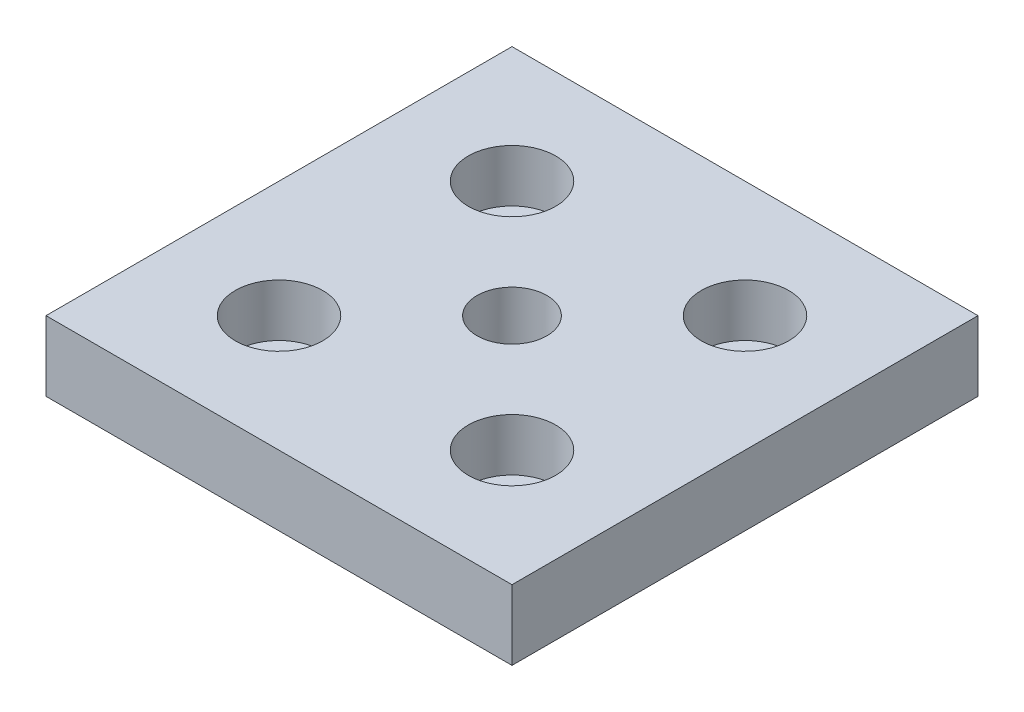
ISO-10303-21;
HEADER;
FILE_DESCRIPTION(('STEP AP214'),'2;1');
FILE_NAME('part.step','',(''),(''),'','','');
FILE_SCHEMA(('AUTOMOTIVE_DESIGN { 1 0 10303 214 1 1 1 1 }'));
ENDSEC;
DATA;
#1=APPLICATION_CONTEXT('core data for automotive mechanical design processes');
#2=APPLICATION_PROTOCOL_DEFINITION('international standard','automotive_design',2000,#1);
#3=PRODUCT_CONTEXT('',#1,'mechanical');
#4=PRODUCT('Part','Part','',(#3));
#5=PRODUCT_RELATED_PRODUCT_CATEGORY('part','',(#4));
#6=PRODUCT_DEFINITION_FORMATION('','',#4);
#7=PRODUCT_DEFINITION_CONTEXT('part definition',#1,'design');
#8=PRODUCT_DEFINITION('design','',#6,#7);
#9=PRODUCT_DEFINITION_SHAPE('','',#8);
#10=(LENGTH_UNIT() NAMED_UNIT(*) SI_UNIT(.MILLI.,.METRE.));
#11=(NAMED_UNIT(*) PLANE_ANGLE_UNIT() SI_UNIT($,.RADIAN.));
#12=(NAMED_UNIT(*) SI_UNIT($,.STERADIAN.) SOLID_ANGLE_UNIT());
#13=UNCERTAINTY_MEASURE_WITH_UNIT(LENGTH_MEASURE(1.E-05),#10,'distance_accuracy_value','');
#14=(GEOMETRIC_REPRESENTATION_CONTEXT(3) GLOBAL_UNCERTAINTY_ASSIGNED_CONTEXT((#13)) GLOBAL_UNIT_ASSIGNED_CONTEXT((#10,
#11,#12)) REPRESENTATION_CONTEXT('',''));
#15=CARTESIAN_POINT('',(0.,0.,0.));
#16=DIRECTION('',(0.,0.,1.));
#17=DIRECTION('',(1.,0.,0.));
#18=AXIS2_PLACEMENT_3D('',#15,#16,#17);
#19=CARTESIAN_POINT('',(-20.,0.,-20.));
#20=DIRECTION('',(0.,1.,0.));
#21=DIRECTION('',(0.,0.,1.));
#22=AXIS2_PLACEMENT_3D('',#19,#20,#21);
#23=CYLINDRICAL_SURFACE('',#22,4.5);
#24=CARTESIAN_POINT('',(-20.,0.,-20.));
#25=DIRECTION('',(0.,1.,0.));
#26=DIRECTION('',(0.,0.,1.));
#27=AXIS2_PLACEMENT_3D('',#24,#25,#26);
#28=CIRCLE('',#27,4.5);
#29=CARTESIAN_POINT('',(-20.,0.,-15.5));
#30=VERTEX_POINT('',#29);
#31=EDGE_CURVE('E137',#30,#30,#28,.T.);
#32=ORIENTED_EDGE('',*,*,#31,.F.);
#33=EDGE_LOOP('',(#32));
#34=FACE_BOUND('',#33,.T.);
#35=CARTESIAN_POINT('',(-20.,3.,-20.));
#36=DIRECTION('',(0.,1.,0.));
#37=DIRECTION('',(0.,0.,1.));
#38=AXIS2_PLACEMENT_3D('',#35,#36,#37);
#39=CIRCLE('',#38,4.5);
#40=CARTESIAN_POINT('',(-20.,3.,-15.5));
#41=VERTEX_POINT('',#40);
#42=EDGE_CURVE('E41',#41,#41,#39,.F.);
#43=ORIENTED_EDGE('',*,*,#42,.F.);
#44=EDGE_LOOP('',(#43));
#45=FACE_BOUND('',#44,.T.);
#46=ADVANCED_FACE('F37',(#34,#45),#23,.F.);
#47=CARTESIAN_POINT('',(20.,0.,-20.));
#48=DIRECTION('',(0.,1.,0.));
#49=DIRECTION('',(0.,0.,1.));
#50=AXIS2_PLACEMENT_3D('',#47,#48,#49);
#51=CYLINDRICAL_SURFACE('',#50,4.5);
#52=CARTESIAN_POINT('',(20.,0.,-20.));
#53=DIRECTION('',(0.,1.,0.));
#54=DIRECTION('',(0.,0.,1.));
#55=AXIS2_PLACEMENT_3D('',#52,#53,#54);
#56=CIRCLE('',#55,4.5);
#57=CARTESIAN_POINT('',(20.,0.,-15.5));
#58=VERTEX_POINT('',#57);
#59=EDGE_CURVE('E133',#58,#58,#56,.T.);
#60=ORIENTED_EDGE('',*,*,#59,.F.);
#61=EDGE_LOOP('',(#60));
#62=FACE_BOUND('',#61,.T.);
#63=CARTESIAN_POINT('',(20.,3.,-20.));
#64=DIRECTION('',(0.,1.,0.));
#65=DIRECTION('',(0.,0.,1.));
#66=AXIS2_PLACEMENT_3D('',#63,#64,#65);
#67=CIRCLE('',#66,4.5);
#68=CARTESIAN_POINT('',(20.,3.,-15.5));
#69=VERTEX_POINT('',#68);
#70=EDGE_CURVE('E119',#69,#69,#67,.F.);
#71=ORIENTED_EDGE('',*,*,#70,.F.);
#72=EDGE_LOOP('',(#71));
#73=FACE_BOUND('',#72,.T.);
#74=ADVANCED_FACE('F165',(#62,#73),#51,.F.);
#75=CARTESIAN_POINT('',(20.,0.,20.));
#76=DIRECTION('',(0.,1.,0.));
#77=DIRECTION('',(0.,0.,1.));
#78=AXIS2_PLACEMENT_3D('',#75,#76,#77);
#79=CYLINDRICAL_SURFACE('',#78,4.5);
#80=CARTESIAN_POINT('',(20.,0.,20.));
#81=DIRECTION('',(0.,1.,0.));
#82=DIRECTION('',(0.,0.,1.));
#83=AXIS2_PLACEMENT_3D('',#80,#81,#82);
#84=CIRCLE('',#83,4.5);
#85=CARTESIAN_POINT('',(20.,0.,24.5));
#86=VERTEX_POINT('',#85);
#87=EDGE_CURVE('E128',#86,#86,#84,.T.);
#88=ORIENTED_EDGE('',*,*,#87,.F.);
#89=EDGE_LOOP('',(#88));
#90=FACE_BOUND('',#89,.T.);
#91=CARTESIAN_POINT('',(20.,3.,20.));
#92=DIRECTION('',(0.,1.,0.));
#93=DIRECTION('',(0.,0.,1.));
#94=AXIS2_PLACEMENT_3D('',#91,#92,#93);
#95=CIRCLE('',#94,4.5);
#96=CARTESIAN_POINT('',(20.,3.,24.5));
#97=VERTEX_POINT('',#96);
#98=EDGE_CURVE('E116',#97,#97,#95,.F.);
#99=ORIENTED_EDGE('',*,*,#98,.F.);
#100=EDGE_LOOP('',(#99));
#101=FACE_BOUND('',#100,.T.);
#102=ADVANCED_FACE('F171',(#90,#101),#79,.F.);
#103=CARTESIAN_POINT('',(-20.,0.,20.));
#104=DIRECTION('',(0.,1.,0.));
#105=DIRECTION('',(0.,0.,1.));
#106=AXIS2_PLACEMENT_3D('',#103,#104,#105);
#107=CYLINDRICAL_SURFACE('',#106,4.5);
#108=CARTESIAN_POINT('',(-20.,0.,20.));
#109=DIRECTION('',(0.,1.,0.));
#110=DIRECTION('',(0.,0.,1.));
#111=AXIS2_PLACEMENT_3D('',#108,#109,#110);
#112=CIRCLE('',#111,4.5);
#113=CARTESIAN_POINT('',(-20.,0.,24.5));
#114=VERTEX_POINT('',#113);
#115=EDGE_CURVE('E124',#114,#114,#112,.T.);
#116=ORIENTED_EDGE('',*,*,#115,.F.);
#117=EDGE_LOOP('',(#116));
#118=FACE_BOUND('',#117,.T.);
#119=CARTESIAN_POINT('',(-20.,3.,20.));
#120=DIRECTION('',(0.,1.,0.));
#121=DIRECTION('',(0.,0.,1.));
#122=AXIS2_PLACEMENT_3D('',#119,#120,#121);
#123=CIRCLE('',#122,4.5);
#124=CARTESIAN_POINT('',(-20.,3.,24.5));
#125=VERTEX_POINT('',#124);
#126=EDGE_CURVE('E113',#125,#125,#123,.F.);
#127=ORIENTED_EDGE('',*,*,#126,.F.);
#128=EDGE_LOOP('',(#127));
#129=FACE_BOUND('',#128,.T.);
#130=ADVANCED_FACE('F178',(#118,#129),#107,.F.);
#131=CARTESIAN_POINT('',(40.,12.,40.));
#132=DIRECTION('',(-1.,0.,0.));
#133=DIRECTION('',(0.,0.,1.));
#134=AXIS2_PLACEMENT_3D('',#131,#132,#133);
#135=PLANE('',#134);
#136=DIRECTION('',(0.,0.,-1.));
#137=VECTOR('',#136,1.);
#138=CARTESIAN_POINT('',(40.,0.,40.));
#139=LINE('',#138,#137);
#140=CARTESIAN_POINT('',(40.,0.,40.));
#141=VERTEX_POINT('',#140);
#142=CARTESIAN_POINT('',(40.,0.,-40.));
#143=VERTEX_POINT('',#142);
#144=EDGE_CURVE('E104',#141,#143,#139,.T.);
#145=ORIENTED_EDGE('',*,*,#144,.T.);
#146=DIRECTION('',(0.,-1.,0.));
#147=VECTOR('',#146,1.);
#148=CARTESIAN_POINT('',(40.,12.,-40.));
#149=LINE('',#148,#147);
#150=CARTESIAN_POINT('',(40.,12.,-40.));
#151=VERTEX_POINT('',#150);
#152=EDGE_CURVE('E11',#151,#143,#149,.T.);
#153=ORIENTED_EDGE('',*,*,#152,.F.);
#154=DIRECTION('',(0.,0.,-1.));
#155=VECTOR('',#154,1.);
#156=CARTESIAN_POINT('',(40.,12.,40.));
#157=LINE('',#156,#155);
#158=CARTESIAN_POINT('',(40.,12.,40.));
#159=VERTEX_POINT('',#158);
#160=EDGE_CURVE('E91',#159,#151,#157,.T.);
#161=ORIENTED_EDGE('',*,*,#160,.F.);
#162=DIRECTION('',(0.,-1.,0.));
#163=VECTOR('',#162,1.);
#164=CARTESIAN_POINT('',(40.,12.,40.));
#165=LINE('',#164,#163);
#166=EDGE_CURVE('E100',#159,#141,#165,.T.);
#167=ORIENTED_EDGE('',*,*,#166,.T.);
#168=EDGE_LOOP('',(#145,#153,#161,#167));
#169=FACE_BOUND('',#168,.T.);
#170=ADVANCED_FACE('F39',(#169),#135,.F.);
#171=CARTESIAN_POINT('',(-40.,12.,-40.));
#172=DIRECTION('',(0.,0.,1.));
#173=DIRECTION('',(1.,0.,0.));
#174=AXIS2_PLACEMENT_3D('',#171,#172,#173);
#175=PLANE('',#174);
#176=DIRECTION('',(-1.,0.,0.));
#177=VECTOR('',#176,1.);
#178=CARTESIAN_POINT('',(-40.,0.,-40.));
#179=LINE('',#178,#177);
#180=CARTESIAN_POINT('',(-40.,0.,-40.));
#181=VERTEX_POINT('',#180);
#182=EDGE_CURVE('E95',#143,#181,#179,.T.);
#183=ORIENTED_EDGE('',*,*,#182,.T.);
#184=DIRECTION('',(0.,-1.,0.));
#185=VECTOR('',#184,1.);
#186=CARTESIAN_POINT('',(-40.,12.,-40.));
#187=LINE('',#186,#185);
#188=CARTESIAN_POINT('',(-40.,12.,-40.));
#189=VERTEX_POINT('',#188);
#190=EDGE_CURVE('E47',#189,#181,#187,.T.);
#191=ORIENTED_EDGE('',*,*,#190,.F.);
#192=DIRECTION('',(-1.,0.,0.));
#193=VECTOR('',#192,1.);
#194=CARTESIAN_POINT('',(-40.,12.,-40.));
#195=LINE('',#194,#193);
#196=EDGE_CURVE('E86',#151,#189,#195,.T.);
#197=ORIENTED_EDGE('',*,*,#196,.F.);
#198=ORIENTED_EDGE('',*,*,#152,.T.);
#199=EDGE_LOOP('',(#183,#191,#197,#198));
#200=FACE_BOUND('',#199,.T.);
#201=ADVANCED_FACE('F94',(#200),#175,.F.);
#202=CARTESIAN_POINT('',(-40.,12.,40.));
#203=DIRECTION('',(1.,0.,0.));
#204=DIRECTION('',(0.,0.,-1.));
#205=AXIS2_PLACEMENT_3D('',#202,#203,#204);
#206=PLANE('',#205);
#207=DIRECTION('',(0.,0.,1.));
#208=VECTOR('',#207,1.);
#209=CARTESIAN_POINT('',(-40.,0.,40.));
#210=LINE('',#209,#208);
#211=CARTESIAN_POINT('',(-40.,0.,40.));
#212=VERTEX_POINT('',#211);
#213=EDGE_CURVE('E73',#181,#212,#210,.T.);
#214=ORIENTED_EDGE('',*,*,#213,.T.);
#215=DIRECTION('',(0.,-1.,0.));
#216=VECTOR('',#215,1.);
#217=CARTESIAN_POINT('',(-40.,12.,40.));
#218=LINE('',#217,#216);
#219=CARTESIAN_POINT('',(-40.,12.,40.));
#220=VERTEX_POINT('',#219);
#221=EDGE_CURVE('E96',#220,#212,#218,.T.);
#222=ORIENTED_EDGE('',*,*,#221,.F.);
#223=DIRECTION('',(0.,0.,1.));
#224=VECTOR('',#223,1.);
#225=CARTESIAN_POINT('',(-40.,12.,40.));
#226=LINE('',#225,#224);
#227=EDGE_CURVE('E89',#189,#220,#226,.T.);
#228=ORIENTED_EDGE('',*,*,#227,.F.);
#229=ORIENTED_EDGE('',*,*,#190,.T.);
#230=EDGE_LOOP('',(#214,#222,#228,#229));
#231=FACE_BOUND('',#230,.T.);
#232=ADVANCED_FACE('F98',(#231),#206,.F.);
#233=CARTESIAN_POINT('',(-40.,12.,40.));
#234=DIRECTION('',(0.,0.,-1.));
#235=DIRECTION('',(-1.,0.,0.));
#236=AXIS2_PLACEMENT_3D('',#233,#234,#235);
#237=PLANE('',#236);
#238=DIRECTION('',(1.,0.,0.));
#239=VECTOR('',#238,1.);
#240=CARTESIAN_POINT('',(-40.,0.,40.));
#241=LINE('',#240,#239);
#242=EDGE_CURVE('E79',#212,#141,#241,.T.);
#243=ORIENTED_EDGE('',*,*,#242,.T.);
#244=ORIENTED_EDGE('',*,*,#166,.F.);
#245=DIRECTION('',(1.,0.,0.));
#246=VECTOR('',#245,1.);
#247=CARTESIAN_POINT('',(-40.,12.,40.));
#248=LINE('',#247,#246);
#249=EDGE_CURVE('E56',#220,#159,#248,.T.);
#250=ORIENTED_EDGE('',*,*,#249,.F.);
#251=ORIENTED_EDGE('',*,*,#221,.T.);
#252=EDGE_LOOP('',(#243,#244,#250,#251));
#253=FACE_BOUND('',#252,.T.);
#254=ADVANCED_FACE('F154',(#253),#237,.F.);
#255=CARTESIAN_POINT('',(0.,12.,0.));
#256=DIRECTION('',(0.,-1.,0.));
#257=DIRECTION('',(0.,0.,-1.));
#258=AXIS2_PLACEMENT_3D('',#255,#256,#257);
#259=PLANE('',#258);
#260=CARTESIAN_POINT('',(-20.,12.,20.));
#261=DIRECTION('',(0.,1.,0.));
#262=DIRECTION('',(0.,0.,1.));
#263=AXIS2_PLACEMENT_3D('',#260,#261,#262);
#264=CIRCLE('',#263,7.5);
#265=CARTESIAN_POINT('',(-20.,12.,27.5));
#266=VERTEX_POINT('',#265);
#267=EDGE_CURVE('E255',#266,#266,#264,.T.);
#268=ORIENTED_EDGE('',*,*,#267,.F.);
#269=EDGE_LOOP('',(#268));
#270=FACE_BOUND('',#269,.T.);
#271=CARTESIAN_POINT('',(20.,12.,20.));
#272=DIRECTION('',(0.,1.,0.));
#273=DIRECTION('',(0.,0.,1.));
#274=AXIS2_PLACEMENT_3D('',#271,#272,#273);
#275=CIRCLE('',#274,7.5);
#276=CARTESIAN_POINT('',(20.,12.,27.5));
#277=VERTEX_POINT('',#276);
#278=EDGE_CURVE('E250',#277,#277,#275,.T.);
#279=ORIENTED_EDGE('',*,*,#278,.F.);
#280=EDGE_LOOP('',(#279));
#281=FACE_BOUND('',#280,.T.);
#282=CARTESIAN_POINT('',(20.,12.,-20.));
#283=DIRECTION('',(0.,1.,0.));
#284=DIRECTION('',(0.,0.,1.));
#285=AXIS2_PLACEMENT_3D('',#282,#283,#284);
#286=CIRCLE('',#285,7.5);
#287=CARTESIAN_POINT('',(20.,12.,-12.5));
#288=VERTEX_POINT('',#287);
#289=EDGE_CURVE('E241',#288,#288,#286,.T.);
#290=ORIENTED_EDGE('',*,*,#289,.F.);
#291=EDGE_LOOP('',(#290));
#292=FACE_BOUND('',#291,.T.);
#293=CARTESIAN_POINT('',(-20.,12.,-20.));
#294=DIRECTION('',(0.,1.,0.));
#295=DIRECTION('',(0.,0.,1.));
#296=AXIS2_PLACEMENT_3D('',#293,#294,#295);
#297=CIRCLE('',#296,7.5);
#298=CARTESIAN_POINT('',(-20.,12.,-12.5));
#299=VERTEX_POINT('',#298);
#300=EDGE_CURVE('E240',#299,#299,#297,.T.);
#301=ORIENTED_EDGE('',*,*,#300,.F.);
#302=EDGE_LOOP('',(#301));
#303=FACE_BOUND('',#302,.T.);
#304=CARTESIAN_POINT('',(0.,12.,0.));
#305=DIRECTION('',(0.,1.,0.));
#306=DIRECTION('',(0.,0.,1.));
#307=AXIS2_PLACEMENT_3D('',#304,#305,#306);
#308=CIRCLE('',#307,6.);
#309=CARTESIAN_POINT('',(0.,12.,6.));
#310=VERTEX_POINT('',#309);
#311=EDGE_CURVE('E140',#310,#310,#308,.T.);
#312=ORIENTED_EDGE('',*,*,#311,.F.);
#313=EDGE_LOOP('',(#312));
#314=FACE_BOUND('',#313,.T.);
#315=ORIENTED_EDGE('',*,*,#160,.T.);
#316=ORIENTED_EDGE('',*,*,#196,.T.);
#317=ORIENTED_EDGE('',*,*,#227,.T.);
#318=ORIENTED_EDGE('',*,*,#249,.T.);
#319=EDGE_LOOP('',(#315,#316,#317,#318));
#320=FACE_BOUND('',#319,.T.);
#321=ADVANCED_FACE('F87',(#270,#281,#292,#303,#314,#320),#259,.F.);
#322=CARTESIAN_POINT('',(0.,0.,0.));
#323=DIRECTION('',(0.,-1.,0.));
#324=DIRECTION('',(0.,0.,-1.));
#325=AXIS2_PLACEMENT_3D('',#322,#323,#324);
#326=PLANE('',#325);
#327=ORIENTED_EDGE('',*,*,#115,.T.);
#328=EDGE_LOOP('',(#327));
#329=FACE_BOUND('',#328,.T.);
#330=ORIENTED_EDGE('',*,*,#87,.T.);
#331=EDGE_LOOP('',(#330));
#332=FACE_BOUND('',#331,.T.);
#333=ORIENTED_EDGE('',*,*,#59,.T.);
#334=EDGE_LOOP('',(#333));
#335=FACE_BOUND('',#334,.T.);
#336=ORIENTED_EDGE('',*,*,#31,.T.);
#337=EDGE_LOOP('',(#336));
#338=FACE_BOUND('',#337,.T.);
#339=CARTESIAN_POINT('',(0.,0.,0.));
#340=DIRECTION('',(0.,-1.,0.));
#341=DIRECTION('',(0.,0.,-1.));
#342=AXIS2_PLACEMENT_3D('',#339,#340,#341);
#343=CIRCLE('',#342,6.);
#344=CARTESIAN_POINT('',(0.,0.,-6.));
#345=VERTEX_POINT('',#344);
#346=EDGE_CURVE('E107',#345,#345,#343,.T.);
#347=ORIENTED_EDGE('',*,*,#346,.F.);
#348=EDGE_LOOP('',(#347));
#349=FACE_BOUND('',#348,.T.);
#350=ORIENTED_EDGE('',*,*,#144,.F.);
#351=ORIENTED_EDGE('',*,*,#242,.F.);
#352=ORIENTED_EDGE('',*,*,#213,.F.);
#353=ORIENTED_EDGE('',*,*,#182,.F.);
#354=EDGE_LOOP('',(#350,#351,#352,#353));
#355=FACE_BOUND('',#354,.T.);
#356=ADVANCED_FACE('F148',(#329,#332,#335,#338,#349,#355),#326,.T.);
#357=CARTESIAN_POINT('',(0.,12.,0.));
#358=DIRECTION('',(0.,1.,0.));
#359=DIRECTION('',(0.,0.,1.));
#360=AXIS2_PLACEMENT_3D('',#357,#358,#359);
#361=CYLINDRICAL_SURFACE('',#360,6.);
#362=ORIENTED_EDGE('',*,*,#311,.T.);
#363=EDGE_LOOP('',(#362));
#364=FACE_BOUND('',#363,.T.);
#365=ORIENTED_EDGE('',*,*,#346,.T.);
#366=EDGE_LOOP('',(#365));
#367=FACE_BOUND('',#366,.T.);
#368=ADVANCED_FACE('F146',(#364,#367),#361,.F.);
#369=CARTESIAN_POINT('',(-20.,3.,20.));
#370=DIRECTION('',(0.,1.,0.));
#371=DIRECTION('',(0.,0.,1.));
#372=AXIS2_PLACEMENT_3D('',#369,#370,#371);
#373=PLANE('',#372);
#374=CARTESIAN_POINT('',(-20.,3.,20.));
#375=DIRECTION('',(0.,1.,0.));
#376=DIRECTION('',(0.,0.,1.));
#377=AXIS2_PLACEMENT_3D('',#374,#375,#376);
#378=CIRCLE('',#377,7.5);
#379=CARTESIAN_POINT('',(-20.,3.,27.5));
#380=VERTEX_POINT('',#379);
#381=EDGE_CURVE('E253',#380,#380,#378,.T.);
#382=ORIENTED_EDGE('',*,*,#381,.T.);
#383=EDGE_LOOP('',(#382));
#384=FACE_BOUND('',#383,.T.);
#385=ORIENTED_EDGE('',*,*,#126,.T.);
#386=EDGE_LOOP('',(#385));
#387=FACE_BOUND('',#386,.T.);
#388=ADVANCED_FACE('F181',(#384,#387),#373,.T.);
#389=CARTESIAN_POINT('',(-20.,3.,20.));
#390=DIRECTION('',(0.,1.,0.));
#391=DIRECTION('',(0.,0.,1.));
#392=AXIS2_PLACEMENT_3D('',#389,#390,#391);
#393=CYLINDRICAL_SURFACE('',#392,7.5);
#394=ORIENTED_EDGE('',*,*,#381,.F.);
#395=EDGE_LOOP('',(#394));
#396=FACE_BOUND('',#395,.T.);
#397=ORIENTED_EDGE('',*,*,#267,.T.);
#398=EDGE_LOOP('',(#397));
#399=FACE_BOUND('',#398,.T.);
#400=ADVANCED_FACE('F186',(#396,#399),#393,.F.);
#401=CARTESIAN_POINT('',(20.,3.,20.));
#402=DIRECTION('',(0.,1.,0.));
#403=DIRECTION('',(0.,0.,1.));
#404=AXIS2_PLACEMENT_3D('',#401,#402,#403);
#405=PLANE('',#404);
#406=CARTESIAN_POINT('',(20.,3.,20.));
#407=DIRECTION('',(0.,1.,0.));
#408=DIRECTION('',(0.,0.,1.));
#409=AXIS2_PLACEMENT_3D('',#406,#407,#408);
#410=CIRCLE('',#409,7.5);
#411=CARTESIAN_POINT('',(20.,3.,27.5));
#412=VERTEX_POINT('',#411);
#413=EDGE_CURVE('E246',#412,#412,#410,.T.);
#414=ORIENTED_EDGE('',*,*,#413,.T.);
#415=EDGE_LOOP('',(#414));
#416=FACE_BOUND('',#415,.T.);
#417=ORIENTED_EDGE('',*,*,#98,.T.);
#418=EDGE_LOOP('',(#417));
#419=FACE_BOUND('',#418,.T.);
#420=ADVANCED_FACE('F194',(#416,#419),#405,.T.);
#421=CARTESIAN_POINT('',(20.,3.,20.));
#422=DIRECTION('',(0.,1.,0.));
#423=DIRECTION('',(0.,0.,1.));
#424=AXIS2_PLACEMENT_3D('',#421,#422,#423);
#425=CYLINDRICAL_SURFACE('',#424,7.5);
#426=ORIENTED_EDGE('',*,*,#413,.F.);
#427=EDGE_LOOP('',(#426));
#428=FACE_BOUND('',#427,.T.);
#429=ORIENTED_EDGE('',*,*,#278,.T.);
#430=EDGE_LOOP('',(#429));
#431=FACE_BOUND('',#430,.T.);
#432=ADVANCED_FACE('F200',(#428,#431),#425,.F.);
#433=CARTESIAN_POINT('',(20.,3.,-20.));
#434=DIRECTION('',(0.,1.,0.));
#435=DIRECTION('',(0.,0.,1.));
#436=AXIS2_PLACEMENT_3D('',#433,#434,#435);
#437=PLANE('',#436);
#438=CARTESIAN_POINT('',(20.,3.,-20.));
#439=DIRECTION('',(0.,1.,0.));
#440=DIRECTION('',(0.,0.,1.));
#441=AXIS2_PLACEMENT_3D('',#438,#439,#440);
#442=CIRCLE('',#441,7.5);
#443=CARTESIAN_POINT('',(20.,3.,-12.5));
#444=VERTEX_POINT('',#443);
#445=EDGE_CURVE('E239',#444,#444,#442,.T.);
#446=ORIENTED_EDGE('',*,*,#445,.T.);
#447=EDGE_LOOP('',(#446));
#448=FACE_BOUND('',#447,.T.);
#449=ORIENTED_EDGE('',*,*,#70,.T.);
#450=EDGE_LOOP('',(#449));
#451=FACE_BOUND('',#450,.T.);
#452=ADVANCED_FACE('F226',(#448,#451),#437,.T.);
#453=CARTESIAN_POINT('',(20.,3.,-20.));
#454=DIRECTION('',(0.,1.,0.));
#455=DIRECTION('',(0.,0.,1.));
#456=AXIS2_PLACEMENT_3D('',#453,#454,#455);
#457=CYLINDRICAL_SURFACE('',#456,7.5);
#458=ORIENTED_EDGE('',*,*,#445,.F.);
#459=EDGE_LOOP('',(#458));
#460=FACE_BOUND('',#459,.T.);
#461=ORIENTED_EDGE('',*,*,#289,.T.);
#462=EDGE_LOOP('',(#461));
#463=FACE_BOUND('',#462,.T.);
#464=ADVANCED_FACE('F207',(#460,#463),#457,.F.);
#465=CARTESIAN_POINT('',(-20.,3.,-20.));
#466=DIRECTION('',(0.,1.,0.));
#467=DIRECTION('',(0.,0.,1.));
#468=AXIS2_PLACEMENT_3D('',#465,#466,#467);
#469=PLANE('',#468);
#470=CARTESIAN_POINT('',(-20.,3.,-20.));
#471=DIRECTION('',(0.,1.,0.));
#472=DIRECTION('',(0.,0.,1.));
#473=AXIS2_PLACEMENT_3D('',#470,#471,#472);
#474=CIRCLE('',#473,7.5);
#475=CARTESIAN_POINT('',(-20.,3.,-12.5));
#476=VERTEX_POINT('',#475);
#477=EDGE_CURVE('E117',#476,#476,#474,.T.);
#478=ORIENTED_EDGE('',*,*,#477,.T.);
#479=EDGE_LOOP('',(#478));
#480=FACE_BOUND('',#479,.T.);
#481=ORIENTED_EDGE('',*,*,#42,.T.);
#482=EDGE_LOOP('',(#481));
#483=FACE_BOUND('',#482,.T.);
#484=ADVANCED_FACE('F203',(#480,#483),#469,.T.);
#485=CARTESIAN_POINT('',(-20.,3.,-20.));
#486=DIRECTION('',(0.,1.,0.));
#487=DIRECTION('',(0.,0.,1.));
#488=AXIS2_PLACEMENT_3D('',#485,#486,#487);
#489=CYLINDRICAL_SURFACE('',#488,7.5);
#490=ORIENTED_EDGE('',*,*,#477,.F.);
#491=EDGE_LOOP('',(#490));
#492=FACE_BOUND('',#491,.T.);
#493=ORIENTED_EDGE('',*,*,#300,.T.);
#494=EDGE_LOOP('',(#493));
#495=FACE_BOUND('',#494,.T.);
#496=ADVANCED_FACE('F206',(#492,#495),#489,.F.);
#497=CLOSED_SHELL('',(#46,#74,#102,#130,#170,#201,#232,#254,#321,#356,#368,#388,#400,#420,#432,
#452,#464,#484,#496));
#498=MANIFOLD_SOLID_BREP('B2',#497);
#499=ADVANCED_BREP_SHAPE_REPRESENTATION('',(#18,#498),#14);
#500=SHAPE_DEFINITION_REPRESENTATION(#9,#499);
ENDSEC;
END-ISO-10303-21;
